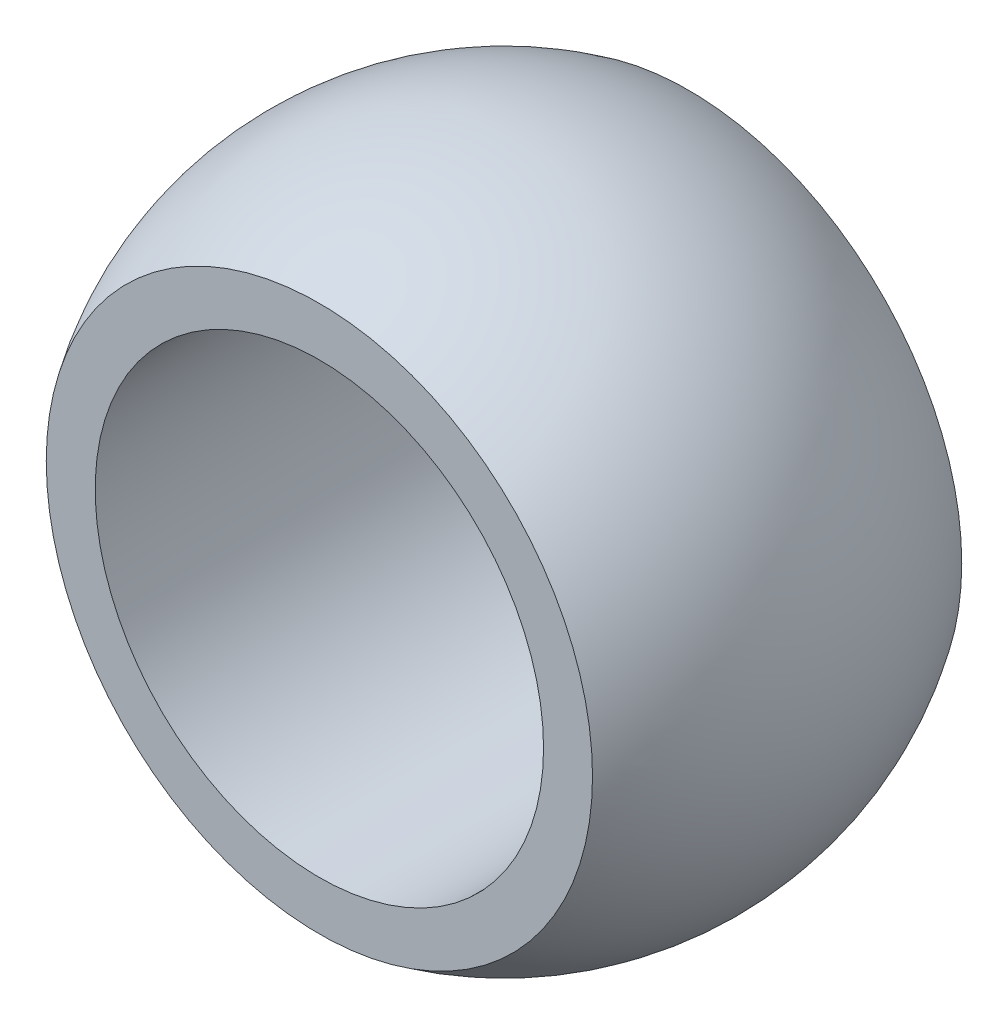
ISO-10303-21;
HEADER;
FILE_DESCRIPTION(('STEP AP214'),'2;1');
FILE_NAME('part.step','',(''),(''),'','','');
FILE_SCHEMA(('AUTOMOTIVE_DESIGN { 1 0 10303 214 1 1 1 1 }'));
ENDSEC;
DATA;
#1=APPLICATION_CONTEXT('core data for automotive mechanical design processes');
#2=APPLICATION_PROTOCOL_DEFINITION('international standard','automotive_design',2000,#1);
#3=PRODUCT_CONTEXT('',#1,'mechanical');
#4=PRODUCT('Part','Part','',(#3));
#5=PRODUCT_RELATED_PRODUCT_CATEGORY('part','',(#4));
#6=PRODUCT_DEFINITION_FORMATION('','',#4);
#7=PRODUCT_DEFINITION_CONTEXT('part definition',#1,'design');
#8=PRODUCT_DEFINITION('design','',#6,#7);
#9=PRODUCT_DEFINITION_SHAPE('','',#8);
#10=(LENGTH_UNIT() NAMED_UNIT(*) SI_UNIT(.MILLI.,.METRE.));
#11=(NAMED_UNIT(*) PLANE_ANGLE_UNIT() SI_UNIT($,.RADIAN.));
#12=(NAMED_UNIT(*) SI_UNIT($,.STERADIAN.) SOLID_ANGLE_UNIT());
#13=UNCERTAINTY_MEASURE_WITH_UNIT(LENGTH_MEASURE(1.E-05),#10,'distance_accuracy_value','');
#14=(GEOMETRIC_REPRESENTATION_CONTEXT(3) GLOBAL_UNCERTAINTY_ASSIGNED_CONTEXT((#13)) GLOBAL_UNIT_ASSIGNED_CONTEXT((#10,
#11,#12)) REPRESENTATION_CONTEXT('',''));
#15=CARTESIAN_POINT('',(0.,0.,0.));
#16=DIRECTION('',(0.,0.,1.));
#17=DIRECTION('',(1.,0.,0.));
#18=AXIS2_PLACEMENT_3D('',#15,#16,#17);
#19=CARTESIAN_POINT('',(0.,0.,0.));
#20=DIRECTION('',(0.,0.999999999999999,0.));
#21=DIRECTION('',(1.,0.,0.));
#22=AXIS2_PLACEMENT_3D('',#19,#20,#21);
#23=SPHERICAL_SURFACE('',#22,12.5);
#24=CARTESIAN_POINT('',(0.,0.,0.));
#25=DIRECTION('',(0.,0.,1.));
#26=DIRECTION('',(1.,0.,0.));
#27=AXIS2_PLACEMENT_3D('',#24,#25,#26);
#28=SPHERICAL_SURFACE('',#27,12.5);
#29=CARTESIAN_POINT('',(0.,0.,-6.99999999999996));
#30=DIRECTION('',(0.,0.,0.999999999999999));
#31=DIRECTION('',(1.,0.,0.));
#32=AXIS2_PLACEMENT_3D('',#29,#30,#31);
#33=CIRCLE('',#32,10.356157588604);
#34=CARTESIAN_POINT('',(10.356157588604,0.,-6.99999999999996));
#35=VERTEX_POINT('',#34);
#36=EDGE_CURVE('E41',#35,#35,#33,.T.);
#37=ORIENTED_EDGE('',*,*,#36,.T.);
#38=EDGE_LOOP('',(#37));
#39=FACE_BOUND('',#38,.T.);
#40=CARTESIAN_POINT('',(0.,0.,7.00000000000007));
#41=DIRECTION('',(0.,0.,-0.999999999999998));
#42=DIRECTION('',(-1.,0.,0.));
#43=AXIS2_PLACEMENT_3D('',#40,#41,#42);
#44=CIRCLE('',#43,10.356157588604);
#45=CARTESIAN_POINT('',(-10.356157588604,0.,7.00000000000007));
#46=VERTEX_POINT('',#45);
#47=EDGE_CURVE('E10',#46,#46,#44,.T.);
#48=ORIENTED_EDGE('',*,*,#47,.T.);
#49=EDGE_LOOP('',(#48));
#50=FACE_BOUND('',#49,.T.);
#51=ADVANCED_FACE('F38',(#39,#50),#28,.T.);
#52=CARTESIAN_POINT('',(-11.,-28.,7.00000000000003));
#53=DIRECTION('',(0.,0.,-0.999999999999998));
#54=DIRECTION('',(-1.,0.,0.));
#55=AXIS2_PLACEMENT_3D('',#52,#53,#54);
#56=PLANE('',#55);
#57=CARTESIAN_POINT('',(0.,0.,7.00000000000007));
#58=DIRECTION('',(0.,0.,0.999999999999998));
#59=DIRECTION('',(1.,0.,0.));
#60=AXIS2_PLACEMENT_3D('',#57,#58,#59);
#61=CIRCLE('',#60,8.5);
#62=CARTESIAN_POINT('',(8.5,0.,7.00000000000006));
#63=VERTEX_POINT('',#62);
#64=EDGE_CURVE('E56',#63,#63,#61,.T.);
#65=ORIENTED_EDGE('',*,*,#64,.F.);
#66=EDGE_LOOP('',(#65));
#67=FACE_BOUND('',#66,.T.);
#68=ORIENTED_EDGE('',*,*,#47,.F.);
#69=EDGE_LOOP('',(#68));
#70=FACE_BOUND('',#69,.T.);
#71=ADVANCED_FACE('F64',(#67,#70),#56,.F.);
#72=CARTESIAN_POINT('',(-11.,-28.,-6.99999999999992));
#73=DIRECTION('',(0.,0.,0.999999999999999));
#74=DIRECTION('',(1.,0.,0.));
#75=AXIS2_PLACEMENT_3D('',#72,#73,#74);
#76=PLANE('',#75);
#77=CARTESIAN_POINT('',(0.,0.,-6.99999999999996));
#78=DIRECTION('',(0.,0.,0.999999999999998));
#79=DIRECTION('',(1.,0.,0.));
#80=AXIS2_PLACEMENT_3D('',#77,#78,#79);
#81=CIRCLE('',#80,8.5);
#82=CARTESIAN_POINT('',(8.49999999999997,0.,-6.99999999999996));
#83=VERTEX_POINT('',#82);
#84=EDGE_CURVE('E51',#83,#83,#81,.T.);
#85=ORIENTED_EDGE('',*,*,#84,.T.);
#86=EDGE_LOOP('',(#85));
#87=FACE_BOUND('',#86,.T.);
#88=ORIENTED_EDGE('',*,*,#36,.F.);
#89=EDGE_LOOP('',(#88));
#90=FACE_BOUND('',#89,.T.);
#91=ADVANCED_FACE('F67',(#87,#90),#76,.F.);
#92=CARTESIAN_POINT('',(0.,0.,-6.99999999999996));
#93=DIRECTION('',(0.,0.,0.999999999999998));
#94=DIRECTION('',(1.,0.,0.));
#95=AXIS2_PLACEMENT_3D('',#92,#93,#94);
#96=CYLINDRICAL_SURFACE('',#95,8.5);
#97=ORIENTED_EDGE('',*,*,#84,.F.);
#98=EDGE_LOOP('',(#97));
#99=FACE_BOUND('',#98,.T.);
#100=ORIENTED_EDGE('',*,*,#64,.T.);
#101=EDGE_LOOP('',(#100));
#102=FACE_BOUND('',#101,.T.);
#103=ADVANCED_FACE('F62',(#99,#102),#96,.F.);
#104=CLOSED_SHELL('',(#51,#71,#91,#103));
#105=MANIFOLD_SOLID_BREP('B2',#104);
#106=ADVANCED_BREP_SHAPE_REPRESENTATION('',(#18,#105),#14);
#107=SHAPE_DEFINITION_REPRESENTATION(#9,#106);
ENDSEC;
END-ISO-10303-21;
